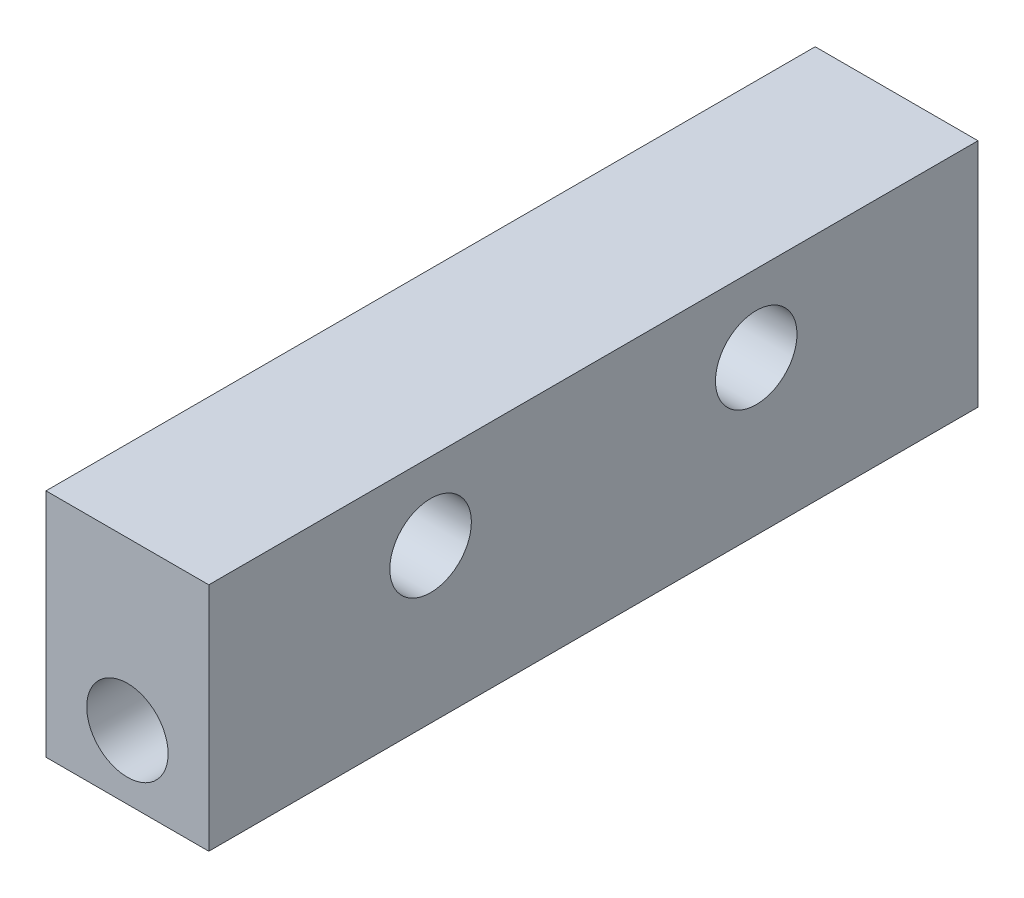
ISO-10303-21;
HEADER;
FILE_DESCRIPTION(('STEP AP214'),'2;1');
FILE_NAME('part.step','',(''),(''),'','','');
FILE_SCHEMA(('AUTOMOTIVE_DESIGN { 1 0 10303 214 1 1 1 1 }'));
ENDSEC;
DATA;
#1=APPLICATION_CONTEXT('core data for automotive mechanical design processes');
#2=APPLICATION_PROTOCOL_DEFINITION('international standard','automotive_design',2000,#1);
#3=PRODUCT_CONTEXT('',#1,'mechanical');
#4=PRODUCT('Part','Part','',(#3));
#5=PRODUCT_RELATED_PRODUCT_CATEGORY('part','',(#4));
#6=PRODUCT_DEFINITION_FORMATION('','',#4);
#7=PRODUCT_DEFINITION_CONTEXT('part definition',#1,'design');
#8=PRODUCT_DEFINITION('design','',#6,#7);
#9=PRODUCT_DEFINITION_SHAPE('','',#8);
#10=(LENGTH_UNIT() NAMED_UNIT(*) SI_UNIT(.MILLI.,.METRE.));
#11=(NAMED_UNIT(*) PLANE_ANGLE_UNIT() SI_UNIT($,.RADIAN.));
#12=(NAMED_UNIT(*) SI_UNIT($,.STERADIAN.) SOLID_ANGLE_UNIT());
#13=UNCERTAINTY_MEASURE_WITH_UNIT(LENGTH_MEASURE(1.E-05),#10,'distance_accuracy_value','');
#14=(GEOMETRIC_REPRESENTATION_CONTEXT(3) GLOBAL_UNCERTAINTY_ASSIGNED_CONTEXT((#13)) GLOBAL_UNIT_ASSIGNED_CONTEXT((#10,
#11,#12)) REPRESENTATION_CONTEXT('',''));
#15=CARTESIAN_POINT('',(0.,0.,0.));
#16=DIRECTION('',(0.,0.,1.));
#17=DIRECTION('',(1.,0.,0.));
#18=AXIS2_PLACEMENT_3D('',#15,#16,#17);
#19=CARTESIAN_POINT('',(0.,0.,30.));
#20=DIRECTION('',(0.,0.,1.));
#21=DIRECTION('',(1.,0.,0.));
#22=AXIS2_PLACEMENT_3D('',#19,#20,#21);
#23=PLANE('',#22);
#24=DIRECTION('',(0.,-1.,0.));
#25=VECTOR('',#24,1.);
#26=CARTESIAN_POINT('',(0.,0.,30.));
#27=LINE('',#26,#25);
#28=CARTESIAN_POINT('',(0.,0.,30.));
#29=VERTEX_POINT('',#28);
#30=CARTESIAN_POINT('',(0.,-9.,30.));
#31=VERTEX_POINT('',#30);
#32=EDGE_CURVE('E89',#29,#31,#27,.T.);
#33=ORIENTED_EDGE('',*,*,#32,.T.);
#34=DIRECTION('',(1.,0.,0.));
#35=VECTOR('',#34,1.);
#36=CARTESIAN_POINT('',(0.,-9.,30.));
#37=LINE('',#36,#35);
#38=CARTESIAN_POINT('',(6.35,-9.,30.));
#39=VERTEX_POINT('',#38);
#40=EDGE_CURVE('E84',#31,#39,#37,.T.);
#41=ORIENTED_EDGE('',*,*,#40,.T.);
#42=DIRECTION('',(0.,1.,0.));
#43=VECTOR('',#42,1.);
#44=CARTESIAN_POINT('',(6.35,0.,30.));
#45=LINE('',#44,#43);
#46=CARTESIAN_POINT('',(6.35,0.,30.));
#47=VERTEX_POINT('',#46);
#48=EDGE_CURVE('E87',#39,#47,#45,.T.);
#49=ORIENTED_EDGE('',*,*,#48,.T.);
#50=DIRECTION('',(-1.,0.,0.));
#51=VECTOR('',#50,1.);
#52=CARTESIAN_POINT('',(0.,0.,30.));
#53=LINE('',#52,#51);
#54=EDGE_CURVE('E54',#47,#29,#53,.T.);
#55=ORIENTED_EDGE('',*,*,#54,.T.);
#56=EDGE_LOOP('',(#33,#41,#49,#55));
#57=FACE_BOUND('',#56,.T.);
#58=CARTESIAN_POINT('',(3.175,-6.5,30.));
#59=DIRECTION('',(0.,0.,1.));
#60=DIRECTION('',(1.,0.,0.));
#61=AXIS2_PLACEMENT_3D('',#58,#59,#60);
#62=CIRCLE('',#61,1.5875);
#63=CARTESIAN_POINT('',(4.7625,-6.5,30.));
#64=VERTEX_POINT('',#63);
#65=EDGE_CURVE('E105',#64,#64,#62,.T.);
#66=ORIENTED_EDGE('',*,*,#65,.F.);
#67=EDGE_LOOP('',(#66));
#68=FACE_BOUND('',#67,.T.);
#69=ADVANCED_FACE('F35',(#57,#68),#23,.T.);
#70=CARTESIAN_POINT('',(0.,0.,0.));
#71=DIRECTION('',(0.,0.,1.));
#72=DIRECTION('',(1.,0.,0.));
#73=AXIS2_PLACEMENT_3D('',#70,#71,#72);
#74=PLANE('',#73);
#75=DIRECTION('',(0.,-1.,0.));
#76=VECTOR('',#75,1.);
#77=CARTESIAN_POINT('',(0.,0.,0.));
#78=LINE('',#77,#76);
#79=CARTESIAN_POINT('',(0.,0.,0.));
#80=VERTEX_POINT('',#79);
#81=CARTESIAN_POINT('',(0.,-9.,0.));
#82=VERTEX_POINT('',#81);
#83=EDGE_CURVE('E102',#80,#82,#78,.T.);
#84=ORIENTED_EDGE('',*,*,#83,.F.);
#85=DIRECTION('',(-1.,0.,0.));
#86=VECTOR('',#85,1.);
#87=CARTESIAN_POINT('',(0.,0.,0.));
#88=LINE('',#87,#86);
#89=CARTESIAN_POINT('',(6.35,0.,0.));
#90=VERTEX_POINT('',#89);
#91=EDGE_CURVE('E77',#90,#80,#88,.T.);
#92=ORIENTED_EDGE('',*,*,#91,.F.);
#93=DIRECTION('',(0.,1.,0.));
#94=VECTOR('',#93,1.);
#95=CARTESIAN_POINT('',(6.35,0.,0.));
#96=LINE('',#95,#94);
#97=CARTESIAN_POINT('',(6.35,-9.,0.));
#98=VERTEX_POINT('',#97);
#99=EDGE_CURVE('E71',#98,#90,#96,.T.);
#100=ORIENTED_EDGE('',*,*,#99,.F.);
#101=DIRECTION('',(1.,0.,0.));
#102=VECTOR('',#101,1.);
#103=CARTESIAN_POINT('',(0.,-9.,0.));
#104=LINE('',#103,#102);
#105=EDGE_CURVE('E93',#82,#98,#104,.T.);
#106=ORIENTED_EDGE('',*,*,#105,.F.);
#107=EDGE_LOOP('',(#84,#92,#100,#106));
#108=FACE_BOUND('',#107,.T.);
#109=CARTESIAN_POINT('',(3.175,-6.5,0.));
#110=DIRECTION('',(0.,0.,1.));
#111=DIRECTION('',(1.,0.,0.));
#112=AXIS2_PLACEMENT_3D('',#109,#110,#111);
#113=CIRCLE('',#112,1.5875);
#114=CARTESIAN_POINT('',(4.7625,-6.5,0.));
#115=VERTEX_POINT('',#114);
#116=EDGE_CURVE('E116',#115,#115,#113,.T.);
#117=ORIENTED_EDGE('',*,*,#116,.T.);
#118=EDGE_LOOP('',(#117));
#119=FACE_BOUND('',#118,.T.);
#120=ADVANCED_FACE('F130',(#108,#119),#74,.F.);
#121=CARTESIAN_POINT('',(0.,0.,30.));
#122=DIRECTION('',(1.,0.,0.));
#123=DIRECTION('',(0.,1.,0.));
#124=AXIS2_PLACEMENT_3D('',#121,#122,#123);
#125=PLANE('',#124);
#126=CARTESIAN_POINT('',(0.,-3.,21.35));
#127=DIRECTION('',(1.,0.,0.));
#128=DIRECTION('',(0.,0.,-1.));
#129=AXIS2_PLACEMENT_3D('',#126,#127,#128);
#130=CIRCLE('',#129,1.59);
#131=CARTESIAN_POINT('',(0.,-3.,19.76));
#132=VERTEX_POINT('',#131);
#133=EDGE_CURVE('E112',#132,#132,#130,.T.);
#134=ORIENTED_EDGE('',*,*,#133,.T.);
#135=EDGE_LOOP('',(#134));
#136=FACE_BOUND('',#135,.T.);
#137=CARTESIAN_POINT('',(0.,-3.,8.65));
#138=DIRECTION('',(1.,0.,0.));
#139=DIRECTION('',(0.,0.,-1.));
#140=AXIS2_PLACEMENT_3D('',#137,#138,#139);
#141=CIRCLE('',#140,1.59);
#142=CARTESIAN_POINT('',(0.,-3.,7.06));
#143=VERTEX_POINT('',#142);
#144=EDGE_CURVE('E118',#143,#143,#141,.T.);
#145=ORIENTED_EDGE('',*,*,#144,.T.);
#146=EDGE_LOOP('',(#145));
#147=FACE_BOUND('',#146,.T.);
#148=ORIENTED_EDGE('',*,*,#83,.T.);
#149=DIRECTION('',(0.,0.,-1.));
#150=VECTOR('',#149,1.);
#151=CARTESIAN_POINT('',(0.,-9.,30.));
#152=LINE('',#151,#150);
#153=EDGE_CURVE('E11',#31,#82,#152,.T.);
#154=ORIENTED_EDGE('',*,*,#153,.F.);
#155=ORIENTED_EDGE('',*,*,#32,.F.);
#156=DIRECTION('',(0.,0.,-1.));
#157=VECTOR('',#156,1.);
#158=CARTESIAN_POINT('',(0.,0.,30.));
#159=LINE('',#158,#157);
#160=EDGE_CURVE('E98',#29,#80,#159,.T.);
#161=ORIENTED_EDGE('',*,*,#160,.T.);
#162=EDGE_LOOP('',(#148,#154,#155,#161));
#163=FACE_BOUND('',#162,.T.);
#164=ADVANCED_FACE('F37',(#136,#147,#163),#125,.F.);
#165=CARTESIAN_POINT('',(0.,-9.,30.));
#166=DIRECTION('',(0.,1.,0.));
#167=DIRECTION('',(0.,0.,1.));
#168=AXIS2_PLACEMENT_3D('',#165,#166,#167);
#169=PLANE('',#168);
#170=ORIENTED_EDGE('',*,*,#105,.T.);
#171=DIRECTION('',(0.,0.,-1.));
#172=VECTOR('',#171,1.);
#173=CARTESIAN_POINT('',(6.35,-9.,30.));
#174=LINE('',#173,#172);
#175=EDGE_CURVE('E45',#39,#98,#174,.T.);
#176=ORIENTED_EDGE('',*,*,#175,.F.);
#177=ORIENTED_EDGE('',*,*,#40,.F.);
#178=ORIENTED_EDGE('',*,*,#153,.T.);
#179=EDGE_LOOP('',(#170,#176,#177,#178));
#180=FACE_BOUND('',#179,.T.);
#181=ADVANCED_FACE('F92',(#180),#169,.F.);
#182=CARTESIAN_POINT('',(6.35,0.,30.));
#183=DIRECTION('',(-1.,0.,0.));
#184=DIRECTION('',(0.,-1.,0.));
#185=AXIS2_PLACEMENT_3D('',#182,#183,#184);
#186=PLANE('',#185);
#187=CARTESIAN_POINT('',(6.35,-3.,21.35));
#188=DIRECTION('',(-1.,0.,0.));
#189=DIRECTION('',(0.,-1.,0.));
#190=AXIS2_PLACEMENT_3D('',#187,#188,#189);
#191=CIRCLE('',#190,1.59);
#192=CARTESIAN_POINT('',(6.35,-4.59,21.35));
#193=VERTEX_POINT('',#192);
#194=EDGE_CURVE('E39',#193,#193,#191,.F.);
#195=ORIENTED_EDGE('',*,*,#194,.F.);
#196=EDGE_LOOP('',(#195));
#197=FACE_BOUND('',#196,.T.);
#198=CARTESIAN_POINT('',(6.35,-3.,8.65));
#199=DIRECTION('',(-1.,0.,0.));
#200=DIRECTION('',(0.,-1.,0.));
#201=AXIS2_PLACEMENT_3D('',#198,#199,#200);
#202=CIRCLE('',#201,1.59);
#203=CARTESIAN_POINT('',(6.35,-4.59,8.65));
#204=VERTEX_POINT('',#203);
#205=EDGE_CURVE('E110',#204,#204,#202,.F.);
#206=ORIENTED_EDGE('',*,*,#205,.F.);
#207=EDGE_LOOP('',(#206));
#208=FACE_BOUND('',#207,.T.);
#209=ORIENTED_EDGE('',*,*,#99,.T.);
#210=DIRECTION('',(0.,0.,-1.));
#211=VECTOR('',#210,1.);
#212=CARTESIAN_POINT('',(6.35,0.,30.));
#213=LINE('',#212,#211);
#214=EDGE_CURVE('E94',#47,#90,#213,.T.);
#215=ORIENTED_EDGE('',*,*,#214,.F.);
#216=ORIENTED_EDGE('',*,*,#48,.F.);
#217=ORIENTED_EDGE('',*,*,#175,.T.);
#218=EDGE_LOOP('',(#209,#215,#216,#217));
#219=FACE_BOUND('',#218,.T.);
#220=ADVANCED_FACE('F96',(#197,#208,#219),#186,.F.);
#221=CARTESIAN_POINT('',(0.,0.,30.));
#222=DIRECTION('',(0.,-1.,0.));
#223=DIRECTION('',(0.,0.,-1.));
#224=AXIS2_PLACEMENT_3D('',#221,#222,#223);
#225=PLANE('',#224);
#226=ORIENTED_EDGE('',*,*,#91,.T.);
#227=ORIENTED_EDGE('',*,*,#160,.F.);
#228=ORIENTED_EDGE('',*,*,#54,.F.);
#229=ORIENTED_EDGE('',*,*,#214,.T.);
#230=EDGE_LOOP('',(#226,#227,#228,#229));
#231=FACE_BOUND('',#230,.T.);
#232=ADVANCED_FACE('F135',(#231),#225,.F.);
#233=CARTESIAN_POINT('',(3.175,-6.5,30.));
#234=DIRECTION('',(0.,0.,-1.));
#235=DIRECTION('',(-1.,0.,0.));
#236=AXIS2_PLACEMENT_3D('',#233,#234,#235);
#237=CYLINDRICAL_SURFACE('',#236,1.5875);
#238=ORIENTED_EDGE('',*,*,#65,.T.);
#239=EDGE_LOOP('',(#238));
#240=FACE_BOUND('',#239,.T.);
#241=ORIENTED_EDGE('',*,*,#116,.F.);
#242=EDGE_LOOP('',(#241));
#243=FACE_BOUND('',#242,.T.);
#244=ADVANCED_FACE('F132',(#240,#243),#237,.F.);
#245=CARTESIAN_POINT('',(30.,-3.,8.65));
#246=DIRECTION('',(-1.,0.,0.));
#247=DIRECTION('',(0.,0.,1.));
#248=AXIS2_PLACEMENT_3D('',#245,#246,#247);
#249=CYLINDRICAL_SURFACE('',#248,1.59);
#250=ORIENTED_EDGE('',*,*,#144,.F.);
#251=EDGE_LOOP('',(#250));
#252=FACE_BOUND('',#251,.T.);
#253=ORIENTED_EDGE('',*,*,#205,.T.);
#254=EDGE_LOOP('',(#253));
#255=FACE_BOUND('',#254,.T.);
#256=ADVANCED_FACE('F134',(#252,#255),#249,.F.);
#257=CARTESIAN_POINT('',(30.,-3.,21.35));
#258=DIRECTION('',(-1.,0.,0.));
#259=DIRECTION('',(0.,0.,1.));
#260=AXIS2_PLACEMENT_3D('',#257,#258,#259);
#261=CYLINDRICAL_SURFACE('',#260,1.59);
#262=ORIENTED_EDGE('',*,*,#133,.F.);
#263=EDGE_LOOP('',(#262));
#264=FACE_BOUND('',#263,.T.);
#265=ORIENTED_EDGE('',*,*,#194,.T.);
#266=EDGE_LOOP('',(#265));
#267=FACE_BOUND('',#266,.T.);
#268=ADVANCED_FACE('F142',(#264,#267),#261,.F.);
#269=CLOSED_SHELL('',(#69,#120,#164,#181,#220,#232,#244,#256,#268));
#270=MANIFOLD_SOLID_BREP('B2',#269);
#271=ADVANCED_BREP_SHAPE_REPRESENTATION('',(#18,#270),#14);
#272=SHAPE_DEFINITION_REPRESENTATION(#9,#271);
ENDSEC;
END-ISO-10303-21;
